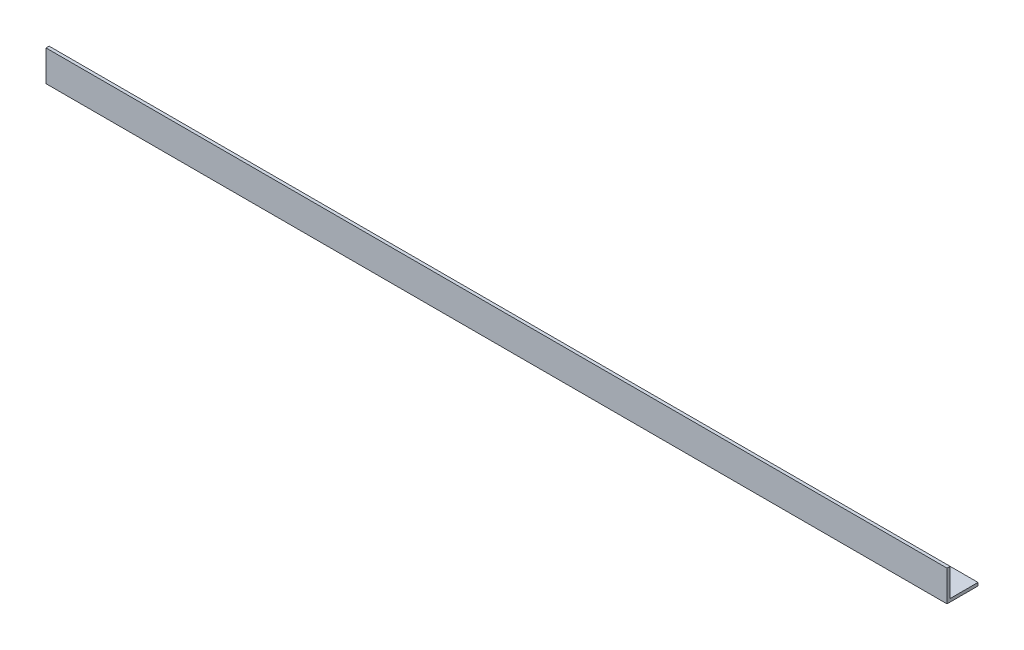
ISO-10303-21;
HEADER;
FILE_DESCRIPTION(('STEP AP214'),'2;1');
FILE_NAME('part.step','',(''),(''),'','','');
FILE_SCHEMA(('AUTOMOTIVE_DESIGN { 1 0 10303 214 1 1 1 1 }'));
ENDSEC;
DATA;
#1=APPLICATION_CONTEXT('core data for automotive mechanical design processes');
#2=APPLICATION_PROTOCOL_DEFINITION('international standard','automotive_design',2000,#1);
#3=PRODUCT_CONTEXT('',#1,'mechanical');
#4=PRODUCT('Part','Part','',(#3));
#5=PRODUCT_RELATED_PRODUCT_CATEGORY('part','',(#4));
#6=PRODUCT_DEFINITION_FORMATION('','',#4);
#7=PRODUCT_DEFINITION_CONTEXT('part definition',#1,'design');
#8=PRODUCT_DEFINITION('design','',#6,#7);
#9=PRODUCT_DEFINITION_SHAPE('','',#8);
#10=(LENGTH_UNIT() NAMED_UNIT(*) SI_UNIT(.MILLI.,.METRE.));
#11=(NAMED_UNIT(*) PLANE_ANGLE_UNIT() SI_UNIT($,.RADIAN.));
#12=(NAMED_UNIT(*) SI_UNIT($,.STERADIAN.) SOLID_ANGLE_UNIT());
#13=UNCERTAINTY_MEASURE_WITH_UNIT(LENGTH_MEASURE(1.E-05),#10,'distance_accuracy_value','');
#14=(GEOMETRIC_REPRESENTATION_CONTEXT(3) GLOBAL_UNCERTAINTY_ASSIGNED_CONTEXT((#13)) GLOBAL_UNIT_ASSIGNED_CONTEXT((#10,
#11,#12)) REPRESENTATION_CONTEXT('',''));
#15=CARTESIAN_POINT('',(0.,0.,0.));
#16=DIRECTION('',(0.,0.,1.));
#17=DIRECTION('',(1.,0.,0.));
#18=AXIS2_PLACEMENT_3D('',#15,#16,#17);
#19=CARTESIAN_POINT('',(436.,0.,-15.));
#20=DIRECTION('',(0.,1.,0.));
#21=DIRECTION('',(0.,0.,1.));
#22=AXIS2_PLACEMENT_3D('',#19,#20,#21);
#23=PLANE('',#22);
#24=DIRECTION('',(0.,0.,-1.));
#25=VECTOR('',#24,1.);
#26=CARTESIAN_POINT('',(0.,0.,-15.));
#27=LINE('',#26,#25);
#28=CARTESIAN_POINT('',(0.,0.,0.));
#29=VERTEX_POINT('',#28);
#30=CARTESIAN_POINT('',(0.,0.,-15.));
#31=VERTEX_POINT('',#30);
#32=EDGE_CURVE('E118',#29,#31,#27,.T.);
#33=ORIENTED_EDGE('',*,*,#32,.T.);
#34=DIRECTION('',(-1.,0.,0.));
#35=VECTOR('',#34,1.);
#36=CARTESIAN_POINT('',(436.,0.,-15.));
#37=LINE('',#36,#35);
#38=CARTESIAN_POINT('',(436.,0.,-15.));
#39=VERTEX_POINT('',#38);
#40=EDGE_CURVE('E11',#39,#31,#37,.T.);
#41=ORIENTED_EDGE('',*,*,#40,.F.);
#42=DIRECTION('',(0.,0.,-1.));
#43=VECTOR('',#42,1.);
#44=CARTESIAN_POINT('',(436.,0.,-15.));
#45=LINE('',#44,#43);
#46=CARTESIAN_POINT('',(436.,0.,0.));
#47=VERTEX_POINT('',#46);
#48=EDGE_CURVE('E128',#47,#39,#45,.T.);
#49=ORIENTED_EDGE('',*,*,#48,.F.);
#50=DIRECTION('',(-1.,0.,0.));
#51=VECTOR('',#50,1.);
#52=CARTESIAN_POINT('',(436.,0.,0.));
#53=LINE('',#52,#51);
#54=EDGE_CURVE('E114',#47,#29,#53,.T.);
#55=ORIENTED_EDGE('',*,*,#54,.T.);
#56=EDGE_LOOP('',(#33,#41,#49,#55));
#57=FACE_BOUND('',#56,.T.);
#58=ADVANCED_FACE('F34',(#57),#23,.F.);
#59=CARTESIAN_POINT('',(436.,1.49999999999998,-15.));
#60=DIRECTION('',(0.,0.,1.));
#61=DIRECTION('',(1.,0.,0.));
#62=AXIS2_PLACEMENT_3D('',#59,#60,#61);
#63=PLANE('',#62);
#64=DIRECTION('',(0.,1.,0.));
#65=VECTOR('',#64,1.);
#66=CARTESIAN_POINT('',(0.,1.49999999999998,-15.));
#67=LINE('',#66,#65);
#68=CARTESIAN_POINT('',(0.,1.49999999999998,-15.));
#69=VERTEX_POINT('',#68);
#70=EDGE_CURVE('E121',#31,#69,#67,.T.);
#71=ORIENTED_EDGE('',*,*,#70,.T.);
#72=DIRECTION('',(-1.,0.,0.));
#73=VECTOR('',#72,1.);
#74=CARTESIAN_POINT('',(436.,1.49999999999998,-15.));
#75=LINE('',#74,#73);
#76=CARTESIAN_POINT('',(436.,1.49999999999998,-15.));
#77=VERTEX_POINT('',#76);
#78=EDGE_CURVE('E42',#77,#69,#75,.T.);
#79=ORIENTED_EDGE('',*,*,#78,.F.);
#80=DIRECTION('',(0.,1.,0.));
#81=VECTOR('',#80,1.);
#82=CARTESIAN_POINT('',(436.,1.49999999999998,-15.));
#83=LINE('',#82,#81);
#84=EDGE_CURVE('E87',#39,#77,#83,.T.);
#85=ORIENTED_EDGE('',*,*,#84,.F.);
#86=ORIENTED_EDGE('',*,*,#40,.T.);
#87=EDGE_LOOP('',(#71,#79,#85,#86));
#88=FACE_BOUND('',#87,.T.);
#89=ADVANCED_FACE('F152',(#88),#63,.F.);
#90=CARTESIAN_POINT('',(436.,1.5,-1.50000000000002));
#91=DIRECTION('',(0.,-1.,0.));
#92=DIRECTION('',(0.,0.,-1.));
#93=AXIS2_PLACEMENT_3D('',#90,#91,#92);
#94=PLANE('',#93);
#95=DIRECTION('',(0.,0.,1.));
#96=VECTOR('',#95,1.);
#97=CARTESIAN_POINT('',(0.,1.5,-1.50000000000002));
#98=LINE('',#97,#96);
#99=CARTESIAN_POINT('',(0.,1.5,-1.50000000000002));
#100=VERTEX_POINT('',#99);
#101=EDGE_CURVE('E123',#69,#100,#98,.T.);
#102=ORIENTED_EDGE('',*,*,#101,.T.);
#103=DIRECTION('',(-1.,0.,0.));
#104=VECTOR('',#103,1.);
#105=CARTESIAN_POINT('',(436.,1.5,-1.50000000000002));
#106=LINE('',#105,#104);
#107=CARTESIAN_POINT('',(436.,1.5,-1.50000000000002));
#108=VERTEX_POINT('',#107);
#109=EDGE_CURVE('E109',#108,#100,#106,.T.);
#110=ORIENTED_EDGE('',*,*,#109,.F.);
#111=DIRECTION('',(0.,0.,1.));
#112=VECTOR('',#111,1.);
#113=CARTESIAN_POINT('',(436.,1.5,-1.50000000000002));
#114=LINE('',#113,#112);
#115=EDGE_CURVE('E100',#77,#108,#114,.T.);
#116=ORIENTED_EDGE('',*,*,#115,.F.);
#117=ORIENTED_EDGE('',*,*,#78,.T.);
#118=EDGE_LOOP('',(#102,#110,#116,#117));
#119=FACE_BOUND('',#118,.T.);
#120=ADVANCED_FACE('F134',(#119),#94,.F.);
#121=CARTESIAN_POINT('',(436.,15.,-1.5));
#122=DIRECTION('',(0.,0.,1.));
#123=DIRECTION('',(0.,-1.,0.));
#124=AXIS2_PLACEMENT_3D('',#121,#122,#123);
#125=PLANE('',#124);
#126=DIRECTION('',(0.,1.,0.));
#127=VECTOR('',#126,1.);
#128=CARTESIAN_POINT('',(0.,15.,-1.5));
#129=LINE('',#128,#127);
#130=CARTESIAN_POINT('',(0.,15.,-1.5));
#131=VERTEX_POINT('',#130);
#132=EDGE_CURVE('E108',#100,#131,#129,.T.);
#133=ORIENTED_EDGE('',*,*,#132,.T.);
#134=DIRECTION('',(-1.,0.,0.));
#135=VECTOR('',#134,1.);
#136=CARTESIAN_POINT('',(436.,15.,-1.5));
#137=LINE('',#136,#135);
#138=CARTESIAN_POINT('',(436.,15.,-1.5));
#139=VERTEX_POINT('',#138);
#140=EDGE_CURVE('E105',#139,#131,#137,.T.);
#141=ORIENTED_EDGE('',*,*,#140,.F.);
#142=DIRECTION('',(0.,1.,0.));
#143=VECTOR('',#142,1.);
#144=CARTESIAN_POINT('',(436.,15.,-1.5));
#145=LINE('',#144,#143);
#146=EDGE_CURVE('E94',#108,#139,#145,.T.);
#147=ORIENTED_EDGE('',*,*,#146,.F.);
#148=ORIENTED_EDGE('',*,*,#109,.T.);
#149=EDGE_LOOP('',(#133,#141,#147,#148));
#150=FACE_BOUND('',#149,.T.);
#151=ADVANCED_FACE('F106',(#150),#125,.F.);
#152=CARTESIAN_POINT('',(436.,15.,0.));
#153=DIRECTION('',(0.,-1.,0.));
#154=DIRECTION('',(0.,0.,-1.));
#155=AXIS2_PLACEMENT_3D('',#152,#153,#154);
#156=PLANE('',#155);
#157=DIRECTION('',(0.,0.,1.));
#158=VECTOR('',#157,1.);
#159=CARTESIAN_POINT('',(0.,15.,0.));
#160=LINE('',#159,#158);
#161=CARTESIAN_POINT('',(0.,15.,0.));
#162=VERTEX_POINT('',#161);
#163=EDGE_CURVE('E73',#131,#162,#160,.T.);
#164=ORIENTED_EDGE('',*,*,#163,.T.);
#165=DIRECTION('',(-1.,0.,0.));
#166=VECTOR('',#165,1.);
#167=CARTESIAN_POINT('',(436.,15.,0.));
#168=LINE('',#167,#166);
#169=CARTESIAN_POINT('',(436.,15.,0.));
#170=VERTEX_POINT('',#169);
#171=EDGE_CURVE('E110',#170,#162,#168,.T.);
#172=ORIENTED_EDGE('',*,*,#171,.F.);
#173=DIRECTION('',(0.,0.,1.));
#174=VECTOR('',#173,1.);
#175=CARTESIAN_POINT('',(436.,15.,0.));
#176=LINE('',#175,#174);
#177=EDGE_CURVE('E98',#139,#170,#176,.T.);
#178=ORIENTED_EDGE('',*,*,#177,.F.);
#179=ORIENTED_EDGE('',*,*,#140,.T.);
#180=EDGE_LOOP('',(#164,#172,#178,#179));
#181=FACE_BOUND('',#180,.T.);
#182=ADVANCED_FACE('F112',(#181),#156,.F.);
#183=CARTESIAN_POINT('',(436.,0.,0.));
#184=DIRECTION('',(0.,0.,-1.));
#185=DIRECTION('',(-1.,0.,0.));
#186=AXIS2_PLACEMENT_3D('',#183,#184,#185);
#187=PLANE('',#186);
#188=DIRECTION('',(0.,-1.,0.));
#189=VECTOR('',#188,1.);
#190=CARTESIAN_POINT('',(0.,0.,0.));
#191=LINE('',#190,#189);
#192=EDGE_CURVE('E79',#162,#29,#191,.T.);
#193=ORIENTED_EDGE('',*,*,#192,.T.);
#194=ORIENTED_EDGE('',*,*,#54,.F.);
#195=DIRECTION('',(0.,-1.,0.));
#196=VECTOR('',#195,1.);
#197=CARTESIAN_POINT('',(436.,0.,0.));
#198=LINE('',#197,#196);
#199=EDGE_CURVE('E50',#170,#47,#198,.T.);
#200=ORIENTED_EDGE('',*,*,#199,.F.);
#201=ORIENTED_EDGE('',*,*,#171,.T.);
#202=EDGE_LOOP('',(#193,#194,#200,#201));
#203=FACE_BOUND('',#202,.T.);
#204=ADVANCED_FACE('F141',(#203),#187,.F.);
#205=CARTESIAN_POINT('',(436.,0.,0.));
#206=DIRECTION('',(-1.,0.,0.));
#207=DIRECTION('',(0.,0.,1.));
#208=AXIS2_PLACEMENT_3D('',#205,#206,#207);
#209=PLANE('',#208);
#210=ORIENTED_EDGE('',*,*,#48,.T.);
#211=ORIENTED_EDGE('',*,*,#84,.T.);
#212=ORIENTED_EDGE('',*,*,#115,.T.);
#213=ORIENTED_EDGE('',*,*,#146,.T.);
#214=ORIENTED_EDGE('',*,*,#177,.T.);
#215=ORIENTED_EDGE('',*,*,#199,.T.);
#216=EDGE_LOOP('',(#210,#211,#212,#213,#214,#215));
#217=FACE_BOUND('',#216,.T.);
#218=ADVANCED_FACE('F96',(#217),#209,.F.);
#219=CARTESIAN_POINT('',(0.,0.,0.));
#220=DIRECTION('',(-1.,0.,0.));
#221=DIRECTION('',(0.,0.,1.));
#222=AXIS2_PLACEMENT_3D('',#219,#220,#221);
#223=PLANE('',#222);
#224=ORIENTED_EDGE('',*,*,#32,.F.);
#225=ORIENTED_EDGE('',*,*,#192,.F.);
#226=ORIENTED_EDGE('',*,*,#163,.F.);
#227=ORIENTED_EDGE('',*,*,#132,.F.);
#228=ORIENTED_EDGE('',*,*,#101,.F.);
#229=ORIENTED_EDGE('',*,*,#70,.F.);
#230=EDGE_LOOP('',(#224,#225,#226,#227,#228,#229));
#231=FACE_BOUND('',#230,.T.);
#232=ADVANCED_FACE('F137',(#231),#223,.T.);
#233=CLOSED_SHELL('',(#58,#89,#120,#151,#182,#204,#218,#232));
#234=MANIFOLD_SOLID_BREP('B2',#233);
#235=ADVANCED_BREP_SHAPE_REPRESENTATION('',(#18,#234),#14);
#236=SHAPE_DEFINITION_REPRESENTATION(#9,#235);
ENDSEC;
END-ISO-10303-21;
